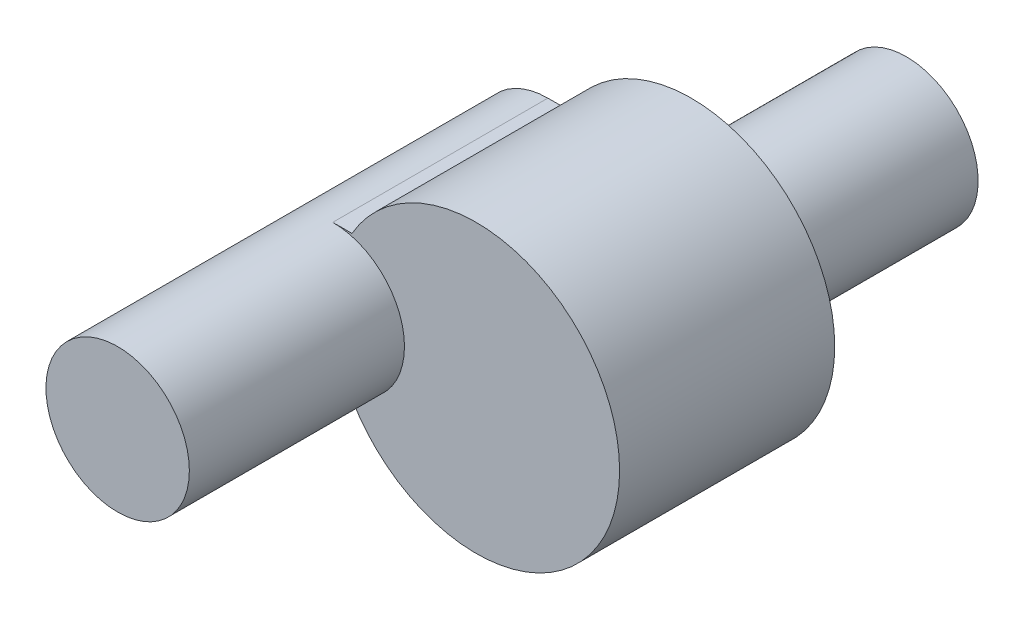
ISO-10303-21;
HEADER;
FILE_DESCRIPTION(('STEP AP214'),'2;1');
FILE_NAME('part.step','',(''),(''),'','','');
FILE_SCHEMA(('AUTOMOTIVE_DESIGN { 1 0 10303 214 1 1 1 1 }'));
ENDSEC;
DATA;
#1=APPLICATION_CONTEXT('core data for automotive mechanical design processes');
#2=APPLICATION_PROTOCOL_DEFINITION('international standard','automotive_design',2000,#1);
#3=PRODUCT_CONTEXT('',#1,'mechanical');
#4=PRODUCT('Part','Part','',(#3));
#5=PRODUCT_RELATED_PRODUCT_CATEGORY('part','',(#4));
#6=PRODUCT_DEFINITION_FORMATION('','',#4);
#7=PRODUCT_DEFINITION_CONTEXT('part definition',#1,'design');
#8=PRODUCT_DEFINITION('design','',#6,#7);
#9=PRODUCT_DEFINITION_SHAPE('','',#8);
#10=(LENGTH_UNIT() NAMED_UNIT(*) SI_UNIT(.MILLI.,.METRE.));
#11=(NAMED_UNIT(*) PLANE_ANGLE_UNIT() SI_UNIT($,.RADIAN.));
#12=(NAMED_UNIT(*) SI_UNIT($,.STERADIAN.) SOLID_ANGLE_UNIT());
#13=UNCERTAINTY_MEASURE_WITH_UNIT(LENGTH_MEASURE(1.E-05),#10,'distance_accuracy_value','');
#14=(GEOMETRIC_REPRESENTATION_CONTEXT(3) GLOBAL_UNCERTAINTY_ASSIGNED_CONTEXT((#13)) GLOBAL_UNIT_ASSIGNED_CONTEXT((#10,
#11,#12)) REPRESENTATION_CONTEXT('',''));
#15=CARTESIAN_POINT('',(0.,0.,0.));
#16=DIRECTION('',(0.,0.,1.));
#17=DIRECTION('',(1.,0.,0.));
#18=AXIS2_PLACEMENT_3D('',#15,#16,#17);
#19=CARTESIAN_POINT('',(0.,0.,0.));
#20=DIRECTION('',(0.,0.,1.));
#21=DIRECTION('',(1.,0.,0.));
#22=AXIS2_PLACEMENT_3D('',#19,#20,#21);
#23=PLANE('',#22);
#24=CARTESIAN_POINT('',(-6.73869484444384,4.39039199384341,0.));
#25=DIRECTION('',(0.,0.,-1.));
#26=DIRECTION('',(-1.,0.,0.));
#27=AXIS2_PLACEMENT_3D('',#24,#25,#26);
#28=CIRCLE('',#27,0.999999999999999);
#29=CARTESIAN_POINT('',(-7.73869484444384,4.39039199384341,0.));
#30=VERTEX_POINT('',#29);
#31=EDGE_CURVE('E12',#30,#30,#28,.T.);
#32=ORIENTED_EDGE('',*,*,#31,.F.);
#33=EDGE_LOOP('',(#32));
#34=FACE_BOUND('',#33,.T.);
#35=CARTESIAN_POINT('',(-8.73869484444385,4.39039199384341,0.));
#36=DIRECTION('',(0.,0.,1.));
#37=DIRECTION('',(1.,0.,0.));
#38=AXIS2_PLACEMENT_3D('',#35,#36,#37);
#39=CIRCLE('',#38,1.);
#40=CARTESIAN_POINT('',(-8.73869484444385,5.39039199384341,0.));
#41=VERTEX_POINT('',#40);
#42=CARTESIAN_POINT('',(-8.73869484444385,3.39039199384341,0.));
#43=VERTEX_POINT('',#42);
#44=EDGE_CURVE('E100',#41,#43,#39,.T.);
#45=ORIENTED_EDGE('',*,*,#44,.F.);
#46=DIRECTION('',(1.,0.,0.));
#47=VECTOR('',#46,1.);
#48=CARTESIAN_POINT('',(0.,5.39039199384346,0.));
#49=LINE('',#48,#47);
#50=CARTESIAN_POINT('',(-8.47074565201272,5.39039199384341,0.));
#51=VERTEX_POINT('',#50);
#52=EDGE_CURVE('E122',#41,#51,#49,.T.);
#53=ORIENTED_EDGE('',*,*,#52,.T.);
#54=CARTESIAN_POINT('',(-6.73869484444384,4.39039199384341,0.));
#55=DIRECTION('',(0.,0.,1.));
#56=DIRECTION('',(1.,0.,0.));
#57=AXIS2_PLACEMENT_3D('',#54,#55,#56);
#58=CIRCLE('',#57,2.);
#59=CARTESIAN_POINT('',(-8.47074565201272,3.39039199384341,0.));
#60=VERTEX_POINT('',#59);
#61=EDGE_CURVE('E137',#60,#51,#58,.T.);
#62=ORIENTED_EDGE('',*,*,#61,.F.);
#63=DIRECTION('',(1.,0.,0.));
#64=VECTOR('',#63,1.);
#65=CARTESIAN_POINT('',(0.,3.39039199384342,0.));
#66=LINE('',#65,#64);
#67=EDGE_CURVE('E135',#43,#60,#66,.T.);
#68=ORIENTED_EDGE('',*,*,#67,.F.);
#69=EDGE_LOOP('',(#45,#53,#62,#68));
#70=FACE_BOUND('',#69,.T.);
#71=ADVANCED_FACE('F63',(#34,#70),#23,.F.);
#72=CARTESIAN_POINT('',(-8.73869484444385,4.39039199384341,3.));
#73=DIRECTION('',(0.,0.,-1.));
#74=DIRECTION('',(-1.,0.,0.));
#75=AXIS2_PLACEMENT_3D('',#72,#73,#74);
#76=CYLINDRICAL_SURFACE('',#75,1.);
#77=ORIENTED_EDGE('',*,*,#44,.T.);
#78=DIRECTION('',(0.,0.,-1.));
#79=VECTOR('',#78,1.);
#80=CARTESIAN_POINT('',(-8.73869484444385,3.39039199384341,3.));
#81=LINE('',#80,#79);
#82=CARTESIAN_POINT('',(-8.73869484444385,3.39039199384341,3.));
#83=VERTEX_POINT('',#82);
#84=EDGE_CURVE('E106',#83,#43,#81,.T.);
#85=ORIENTED_EDGE('',*,*,#84,.F.);
#86=CARTESIAN_POINT('',(-8.73869484444385,4.39039199384341,3.));
#87=DIRECTION('',(0.,0.,1.));
#88=DIRECTION('',(1.,0.,0.));
#89=AXIS2_PLACEMENT_3D('',#86,#87,#88);
#90=CIRCLE('',#89,0.999999999999999);
#91=CARTESIAN_POINT('',(-8.73869484444385,5.39039199384341,3.));
#92=VERTEX_POINT('',#91);
#93=EDGE_CURVE('E73',#83,#92,#90,.T.);
#94=ORIENTED_EDGE('',*,*,#93,.T.);
#95=DIRECTION('',(0.,0.,-1.));
#96=VECTOR('',#95,1.);
#97=CARTESIAN_POINT('',(-8.73869484444385,5.39039199384341,3.));
#98=LINE('',#97,#96);
#99=EDGE_CURVE('E120',#92,#41,#98,.T.);
#100=ORIENTED_EDGE('',*,*,#99,.T.);
#101=EDGE_LOOP('',(#77,#85,#94,#100));
#102=FACE_BOUND('',#101,.T.);
#103=CARTESIAN_POINT('',(-8.73869484444385,4.39039199384341,6.));
#104=DIRECTION('',(0.,0.,1.));
#105=DIRECTION('',(1.,0.,0.));
#106=AXIS2_PLACEMENT_3D('',#103,#104,#105);
#107=CIRCLE('',#106,0.999999999999999);
#108=CARTESIAN_POINT('',(-7.73869484444385,4.39039199384341,6.));
#109=VERTEX_POINT('',#108);
#110=EDGE_CURVE('E131',#109,#109,#107,.T.);
#111=ORIENTED_EDGE('',*,*,#110,.F.);
#112=EDGE_LOOP('',(#111));
#113=FACE_BOUND('',#112,.T.);
#114=ADVANCED_FACE('F126',(#102,#113),#76,.T.);
#115=CARTESIAN_POINT('',(0.,0.,3.));
#116=DIRECTION('',(0.,0.,1.));
#117=DIRECTION('',(1.,0.,0.));
#118=AXIS2_PLACEMENT_3D('',#115,#116,#117);
#119=PLANE('',#118);
#120=ORIENTED_EDGE('',*,*,#93,.F.);
#121=DIRECTION('',(1.,0.,0.));
#122=VECTOR('',#121,1.);
#123=CARTESIAN_POINT('',(0.,3.39039199384342,3.));
#124=LINE('',#123,#122);
#125=CARTESIAN_POINT('',(-8.47074565201272,3.39039199384341,3.));
#126=VERTEX_POINT('',#125);
#127=EDGE_CURVE('E132',#83,#126,#124,.T.);
#128=ORIENTED_EDGE('',*,*,#127,.T.);
#129=CARTESIAN_POINT('',(-6.73869484444384,4.39039199384341,3.));
#130=DIRECTION('',(0.,0.,1.));
#131=DIRECTION('',(1.,0.,0.));
#132=AXIS2_PLACEMENT_3D('',#129,#130,#131);
#133=CIRCLE('',#132,2.);
#134=CARTESIAN_POINT('',(-8.47074565201272,5.39039199384341,3.));
#135=VERTEX_POINT('',#134);
#136=EDGE_CURVE('E111',#126,#135,#133,.T.);
#137=ORIENTED_EDGE('',*,*,#136,.T.);
#138=DIRECTION('',(1.,0.,0.));
#139=VECTOR('',#138,1.);
#140=CARTESIAN_POINT('',(0.,5.39039199384346,3.));
#141=LINE('',#140,#139);
#142=EDGE_CURVE('E114',#92,#135,#141,.T.);
#143=ORIENTED_EDGE('',*,*,#142,.F.);
#144=EDGE_LOOP('',(#120,#128,#137,#143));
#145=FACE_BOUND('',#144,.T.);
#146=ADVANCED_FACE('F116',(#145),#119,.T.);
#147=CARTESIAN_POINT('',(0.,3.39039199384342,3.));
#148=DIRECTION('',(0.,1.,0.));
#149=DIRECTION('',(-1.,0.,0.));
#150=AXIS2_PLACEMENT_3D('',#147,#148,#149);
#151=PLANE('',#150);
#152=ORIENTED_EDGE('',*,*,#67,.T.);
#153=DIRECTION('',(0.,0.,-1.));
#154=VECTOR('',#153,1.);
#155=CARTESIAN_POINT('',(-8.47074565201272,3.39039199384341,3.));
#156=LINE('',#155,#154);
#157=EDGE_CURVE('E67',#126,#60,#156,.T.);
#158=ORIENTED_EDGE('',*,*,#157,.F.);
#159=ORIENTED_EDGE('',*,*,#127,.F.);
#160=ORIENTED_EDGE('',*,*,#84,.T.);
#161=EDGE_LOOP('',(#152,#158,#159,#160));
#162=FACE_BOUND('',#161,.T.);
#163=ADVANCED_FACE('F65',(#162),#151,.F.);
#164=CARTESIAN_POINT('',(-6.73869484444384,4.39039199384341,3.));
#165=DIRECTION('',(0.,0.,-1.));
#166=DIRECTION('',(-1.,0.,0.));
#167=AXIS2_PLACEMENT_3D('',#164,#165,#166);
#168=CYLINDRICAL_SURFACE('',#167,2.);
#169=ORIENTED_EDGE('',*,*,#61,.T.);
#170=DIRECTION('',(0.,0.,-1.));
#171=VECTOR('',#170,1.);
#172=CARTESIAN_POINT('',(-8.47074565201272,5.39039199384341,3.));
#173=LINE('',#172,#171);
#174=EDGE_CURVE('E124',#135,#51,#173,.T.);
#175=ORIENTED_EDGE('',*,*,#174,.F.);
#176=ORIENTED_EDGE('',*,*,#136,.F.);
#177=ORIENTED_EDGE('',*,*,#157,.T.);
#178=EDGE_LOOP('',(#169,#175,#176,#177));
#179=FACE_BOUND('',#178,.T.);
#180=ADVANCED_FACE('F142',(#179),#168,.T.);
#181=CARTESIAN_POINT('',(0.,5.39039199384346,3.));
#182=DIRECTION('',(0.,1.,0.));
#183=DIRECTION('',(-1.,0.,0.));
#184=AXIS2_PLACEMENT_3D('',#181,#182,#183);
#185=PLANE('',#184);
#186=ORIENTED_EDGE('',*,*,#52,.F.);
#187=ORIENTED_EDGE('',*,*,#99,.F.);
#188=ORIENTED_EDGE('',*,*,#142,.T.);
#189=ORIENTED_EDGE('',*,*,#174,.T.);
#190=EDGE_LOOP('',(#186,#187,#188,#189));
#191=FACE_BOUND('',#190,.T.);
#192=ADVANCED_FACE('F121',(#191),#185,.T.);
#193=CARTESIAN_POINT('',(-8.73869484444385,4.39039199384341,6.));
#194=DIRECTION('',(0.,0.,1.));
#195=DIRECTION('',(1.,0.,0.));
#196=AXIS2_PLACEMENT_3D('',#193,#194,#195);
#197=PLANE('',#196);
#198=ORIENTED_EDGE('',*,*,#110,.T.);
#199=EDGE_LOOP('',(#198));
#200=FACE_BOUND('',#199,.T.);
#201=ADVANCED_FACE('F158',(#200),#197,.T.);
#202=CARTESIAN_POINT('',(-6.73869484444384,4.39039199384341,-3.));
#203=DIRECTION('',(0.,0.,1.));
#204=DIRECTION('',(1.,0.,0.));
#205=AXIS2_PLACEMENT_3D('',#202,#203,#204);
#206=CYLINDRICAL_SURFACE('',#205,0.999999999999999);
#207=CARTESIAN_POINT('',(-6.73869484444384,4.39039199384341,-3.));
#208=DIRECTION('',(0.,0.,-1.));
#209=DIRECTION('',(-1.,0.,0.));
#210=AXIS2_PLACEMENT_3D('',#207,#208,#209);
#211=CIRCLE('',#210,0.999999999999999);
#212=CARTESIAN_POINT('',(-7.73869484444384,4.39039199384341,-3.));
#213=VERTEX_POINT('',#212);
#214=EDGE_CURVE('E254',#213,#213,#211,.T.);
#215=ORIENTED_EDGE('',*,*,#214,.F.);
#216=EDGE_LOOP('',(#215));
#217=FACE_BOUND('',#216,.T.);
#218=ORIENTED_EDGE('',*,*,#31,.T.);
#219=EDGE_LOOP('',(#218));
#220=FACE_BOUND('',#219,.T.);
#221=ADVANCED_FACE('F163',(#217,#220),#206,.T.);
#222=CARTESIAN_POINT('',(-6.73869484444384,4.39039199384341,-3.));
#223=DIRECTION('',(0.,0.,-1.));
#224=DIRECTION('',(-1.,0.,0.));
#225=AXIS2_PLACEMENT_3D('',#222,#223,#224);
#226=PLANE('',#225);
#227=ORIENTED_EDGE('',*,*,#214,.T.);
#228=EDGE_LOOP('',(#227));
#229=FACE_BOUND('',#228,.T.);
#230=ADVANCED_FACE('F182',(#229),#226,.T.);
#231=CLOSED_SHELL('',(#71,#114,#146,#163,#180,#192,#201,#221,#230));
#232=MANIFOLD_SOLID_BREP('B2',#231);
#233=ADVANCED_BREP_SHAPE_REPRESENTATION('',(#18,#232),#14);
#234=SHAPE_DEFINITION_REPRESENTATION(#9,#233);
ENDSEC;
END-ISO-10303-21;
